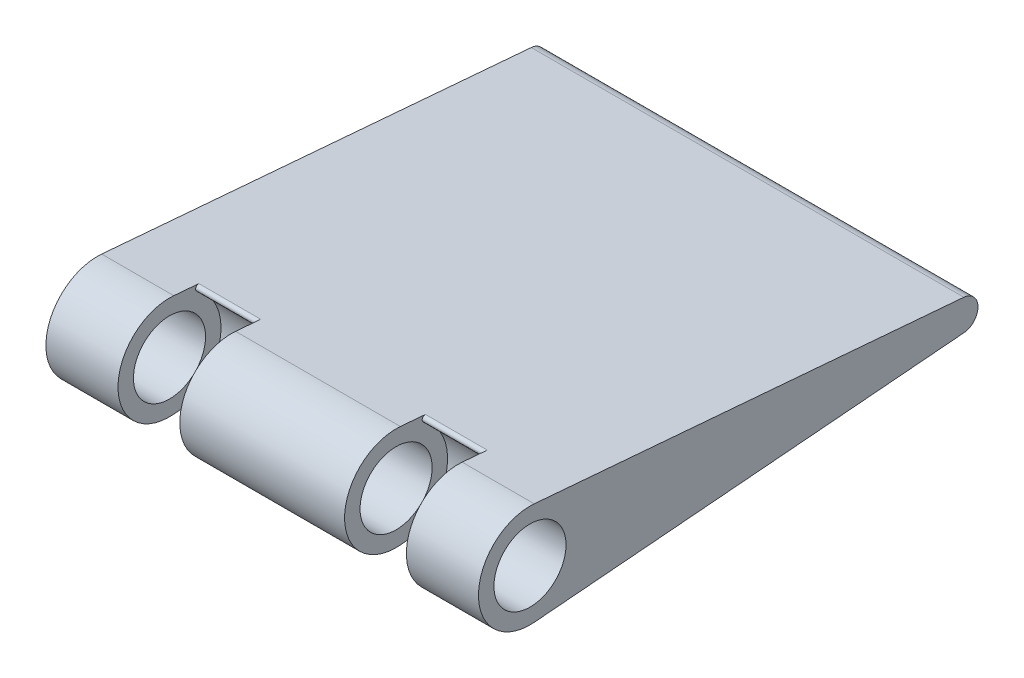
ISO-10303-21;
HEADER;
FILE_DESCRIPTION(('STEP AP214'),'2;1');
FILE_NAME('part.step','',(''),(''),'','','');
FILE_SCHEMA(('AUTOMOTIVE_DESIGN { 1 0 10303 214 1 1 1 1 }'));
ENDSEC;
DATA;
#1=APPLICATION_CONTEXT('core data for automotive mechanical design processes');
#2=APPLICATION_PROTOCOL_DEFINITION('international standard','automotive_design',2000,#1);
#3=PRODUCT_CONTEXT('',#1,'mechanical');
#4=PRODUCT('Part','Part','',(#3));
#5=PRODUCT_RELATED_PRODUCT_CATEGORY('part','',(#4));
#6=PRODUCT_DEFINITION_FORMATION('','',#4);
#7=PRODUCT_DEFINITION_CONTEXT('part definition',#1,'design');
#8=PRODUCT_DEFINITION('design','',#6,#7);
#9=PRODUCT_DEFINITION_SHAPE('','',#8);
#10=(LENGTH_UNIT() NAMED_UNIT(*) SI_UNIT(.MILLI.,.METRE.));
#11=(NAMED_UNIT(*) PLANE_ANGLE_UNIT() SI_UNIT($,.RADIAN.));
#12=(NAMED_UNIT(*) SI_UNIT($,.STERADIAN.) SOLID_ANGLE_UNIT());
#13=UNCERTAINTY_MEASURE_WITH_UNIT(LENGTH_MEASURE(1.E-05),#10,'distance_accuracy_value','');
#14=(GEOMETRIC_REPRESENTATION_CONTEXT(3) GLOBAL_UNCERTAINTY_ASSIGNED_CONTEXT((#13)) GLOBAL_UNIT_ASSIGNED_CONTEXT((#10,
#11,#12)) REPRESENTATION_CONTEXT('',''));
#15=CARTESIAN_POINT('',(0.,0.,0.));
#16=DIRECTION('',(0.,0.,1.));
#17=DIRECTION('',(1.,0.,0.));
#18=AXIS2_PLACEMENT_3D('',#15,#16,#17);
#19=CARTESIAN_POINT('',(21.,0.,0.));
#20=DIRECTION('',(-1.,0.,0.));
#21=DIRECTION('',(0.,0.,1.));
#22=AXIS2_PLACEMENT_3D('',#19,#20,#21);
#23=CYLINDRICAL_SURFACE('',#22,5.);
#24=CARTESIAN_POINT('',(-14.,0.,0.));
#25=DIRECTION('',(1.,0.,0.));
#26=DIRECTION('',(0.,0.,-1.));
#27=AXIS2_PLACEMENT_3D('',#24,#25,#26);
#28=CIRCLE('',#27,5.);
#29=CARTESIAN_POINT('',(-14.,4.98260864295892,-0.416666666666667));
#30=VERTEX_POINT('',#29);
#31=CARTESIAN_POINT('',(-14.,-4.98260864295892,-0.416666666666667));
#32=VERTEX_POINT('',#31);
#33=EDGE_CURVE('E163',#30,#32,#28,.T.);
#34=ORIENTED_EDGE('',*,*,#33,.F.);
#35=DIRECTION('',(-1.,0.,0.));
#36=VECTOR('',#35,1.);
#37=CARTESIAN_POINT('',(21.,4.98260864295892,-0.416666666666662));
#38=LINE('',#37,#36);
#39=CARTESIAN_POINT('',(-21.,4.98260864295892,-0.416666666666662));
#40=VERTEX_POINT('',#39);
#41=EDGE_CURVE('E184',#30,#40,#38,.T.);
#42=ORIENTED_EDGE('',*,*,#41,.T.);
#43=CARTESIAN_POINT('',(-21.,0.,0.));
#44=DIRECTION('',(1.,0.,0.));
#45=DIRECTION('',(0.,0.,-1.));
#46=AXIS2_PLACEMENT_3D('',#43,#44,#45);
#47=CIRCLE('',#46,5.);
#48=CARTESIAN_POINT('',(-21.,-4.98260864295892,-0.416666666666662));
#49=VERTEX_POINT('',#48);
#50=EDGE_CURVE('E173',#40,#49,#47,.T.);
#51=ORIENTED_EDGE('',*,*,#50,.T.);
#52=DIRECTION('',(-1.,0.,0.));
#53=VECTOR('',#52,1.);
#54=CARTESIAN_POINT('',(21.,-4.98260864295892,-0.416666666666662));
#55=LINE('',#54,#53);
#56=EDGE_CURVE('E153',#32,#49,#55,.T.);
#57=ORIENTED_EDGE('',*,*,#56,.F.);
#58=EDGE_LOOP('',(#34,#42,#51,#57));
#59=FACE_BOUND('',#58,.T.);
#60=ADVANCED_FACE('F34',(#59),#23,.T.);
#61=CARTESIAN_POINT('',(21.,0.,0.));
#62=DIRECTION('',(-1.,0.,0.));
#63=DIRECTION('',(0.,0.,1.));
#64=AXIS2_PLACEMENT_3D('',#61,#62,#63);
#65=CYLINDRICAL_SURFACE('',#64,3.5);
#66=CARTESIAN_POINT('',(-21.,0.,0.));
#67=DIRECTION('',(1.,0.,0.));
#68=DIRECTION('',(0.,0.,-1.));
#69=AXIS2_PLACEMENT_3D('',#66,#67,#68);
#70=CIRCLE('',#69,3.5);
#71=CARTESIAN_POINT('',(-21.,0.,-3.5));
#72=VERTEX_POINT('',#71);
#73=EDGE_CURVE('E281',#72,#72,#70,.T.);
#74=ORIENTED_EDGE('',*,*,#73,.F.);
#75=EDGE_LOOP('',(#74));
#76=FACE_BOUND('',#75,.T.);
#77=CARTESIAN_POINT('',(-14.,0.,0.));
#78=DIRECTION('',(1.,0.,0.));
#79=DIRECTION('',(0.,0.,-1.));
#80=AXIS2_PLACEMENT_3D('',#77,#78,#79);
#81=CIRCLE('',#80,3.5);
#82=CARTESIAN_POINT('',(-14.,0.,-3.5));
#83=VERTEX_POINT('',#82);
#84=EDGE_CURVE('E306',#83,#83,#81,.T.);
#85=ORIENTED_EDGE('',*,*,#84,.T.);
#86=EDGE_LOOP('',(#85));
#87=FACE_BOUND('',#86,.T.);
#88=ADVANCED_FACE('F297',(#76,#87),#65,.F.);
#89=CARTESIAN_POINT('',(8.,4.98260864295892,-0.416666666666662));
#90=VERTEX_POINT('',#89);
#91=CARTESIAN_POINT('',(-7.99999999999999,4.98260864295892,-0.416666666666662));
#92=VERTEX_POINT('',#91);
#93=EDGE_CURVE('E188',#90,#92,#38,.T.);
#94=ORIENTED_EDGE('',*,*,#93,.T.);
#95=CARTESIAN_POINT('',(-8.,0.,0.));
#96=DIRECTION('',(1.,0.,0.));
#97=DIRECTION('',(0.,0.,-1.));
#98=AXIS2_PLACEMENT_3D('',#95,#96,#97);
#99=CIRCLE('',#98,5.);
#100=CARTESIAN_POINT('',(-8.,-4.98260864295892,-0.416666666666667));
#101=VERTEX_POINT('',#100);
#102=EDGE_CURVE('E308',#92,#101,#99,.T.);
#103=ORIENTED_EDGE('',*,*,#102,.T.);
#104=CARTESIAN_POINT('',(8.,-4.98260864295892,-0.416666666666662));
#105=VERTEX_POINT('',#104);
#106=EDGE_CURVE('E175',#105,#101,#55,.T.);
#107=ORIENTED_EDGE('',*,*,#106,.F.);
#108=CARTESIAN_POINT('',(8.,0.,0.));
#109=DIRECTION('',(1.,0.,0.));
#110=DIRECTION('',(0.,0.,-1.));
#111=AXIS2_PLACEMENT_3D('',#108,#109,#110);
#112=CIRCLE('',#111,5.);
#113=EDGE_CURVE('E270',#90,#105,#112,.T.);
#114=ORIENTED_EDGE('',*,*,#113,.F.);
#115=EDGE_LOOP('',(#94,#103,#107,#114));
#116=FACE_BOUND('',#115,.T.);
#117=ADVANCED_FACE('F300',(#116),#23,.T.);
#118=CARTESIAN_POINT('',(-8.,0.,0.));
#119=DIRECTION('',(1.,0.,0.));
#120=DIRECTION('',(0.,0.,-1.));
#121=AXIS2_PLACEMENT_3D('',#118,#119,#120);
#122=CIRCLE('',#121,3.5);
#123=CARTESIAN_POINT('',(-8.,0.,-3.5));
#124=VERTEX_POINT('',#123);
#125=EDGE_CURVE('E314',#124,#124,#122,.T.);
#126=ORIENTED_EDGE('',*,*,#125,.F.);
#127=EDGE_LOOP('',(#126));
#128=FACE_BOUND('',#127,.T.);
#129=CARTESIAN_POINT('',(8.,0.,0.));
#130=DIRECTION('',(1.,0.,0.));
#131=DIRECTION('',(0.,0.,-1.));
#132=AXIS2_PLACEMENT_3D('',#129,#130,#131);
#133=CIRCLE('',#132,3.5);
#134=CARTESIAN_POINT('',(8.,0.,-3.5));
#135=VERTEX_POINT('',#134);
#136=EDGE_CURVE('E169',#135,#135,#133,.T.);
#137=ORIENTED_EDGE('',*,*,#136,.T.);
#138=EDGE_LOOP('',(#137));
#139=FACE_BOUND('',#138,.T.);
#140=ADVANCED_FACE('F302',(#128,#139),#65,.F.);
#141=CARTESIAN_POINT('',(21.,-0.173635949773063,-57.9236160382377));
#142=DIRECTION('',(0.,0.996521728591783,0.0833333333333333));
#143=DIRECTION('',(0.,-0.0833333333333333,0.996521728591783));
#144=AXIS2_PLACEMENT_3D('',#141,#142,#143);
#145=PLANE('',#144);
#146=ORIENTED_EDGE('',*,*,#106,.T.);
#147=DIRECTION('',(0.,0.0833333333333333,-0.996521728591783));
#148=VECTOR('',#147,1.);
#149=CARTESIAN_POINT('',(-8.,-0.173635949773063,-57.9236160382377));
#150=LINE('',#149,#148);
#151=CARTESIAN_POINT('',(-8.,-4.77848449772698,-2.8576364193128));
#152=VERTEX_POINT('',#151);
#153=EDGE_CURVE('E217',#101,#152,#150,.T.);
#154=ORIENTED_EDGE('',*,*,#153,.T.);
#155=DIRECTION('',(1.,0.,0.));
#156=VECTOR('',#155,1.);
#157=CARTESIAN_POINT('',(21.,-4.77848449772698,-2.8576364193128));
#158=LINE('',#157,#156);
#159=CARTESIAN_POINT('',(-14.,-4.77848449772698,-2.8576364193128));
#160=VERTEX_POINT('',#159);
#161=EDGE_CURVE('E157',#152,#160,#158,.F.);
#162=ORIENTED_EDGE('',*,*,#161,.T.);
#163=DIRECTION('',(0.,-0.0833333333333333,0.996521728591783));
#164=VECTOR('',#163,1.);
#165=CARTESIAN_POINT('',(-14.,-0.173635949773063,-57.9236160382377));
#166=LINE('',#165,#164);
#167=EDGE_CURVE('E147',#160,#32,#166,.T.);
#168=ORIENTED_EDGE('',*,*,#167,.T.);
#169=ORIENTED_EDGE('',*,*,#56,.T.);
#170=DIRECTION('',(0.,0.0833333333333333,-0.996521728591783));
#171=VECTOR('',#170,1.);
#172=CARTESIAN_POINT('',(-21.,-0.173635949773063,-57.9236160382377));
#173=LINE('',#172,#171);
#174=CARTESIAN_POINT('',(-21.,-1.49478259288768,-42.125));
#175=VERTEX_POINT('',#174);
#176=EDGE_CURVE('E268',#49,#175,#173,.T.);
#177=ORIENTED_EDGE('',*,*,#176,.T.);
#178=DIRECTION('',(-1.,0.,0.));
#179=VECTOR('',#178,1.);
#180=CARTESIAN_POINT('',(21.,-1.49478259288768,-42.125));
#181=LINE('',#180,#179);
#182=CARTESIAN_POINT('',(21.,-1.49478259288768,-42.125));
#183=VERTEX_POINT('',#182);
#184=EDGE_CURVE('E196',#183,#175,#181,.T.);
#185=ORIENTED_EDGE('',*,*,#184,.F.);
#186=DIRECTION('',(0.,0.0833333333333333,-0.996521728591783));
#187=VECTOR('',#186,1.);
#188=CARTESIAN_POINT('',(21.,-0.173635949773063,-57.9236160382377));
#189=LINE('',#188,#187);
#190=CARTESIAN_POINT('',(21.,-4.98260864295892,-0.416666666666662));
#191=VERTEX_POINT('',#190);
#192=EDGE_CURVE('E277',#191,#183,#189,.T.);
#193=ORIENTED_EDGE('',*,*,#192,.F.);
#194=CARTESIAN_POINT('',(14.,-4.98260864295892,-0.416666666666662));
#195=VERTEX_POINT('',#194);
#196=EDGE_CURVE('E178',#191,#195,#55,.T.);
#197=ORIENTED_EDGE('',*,*,#196,.T.);
#198=DIRECTION('',(0.,0.0833333333333333,-0.996521728591783));
#199=VECTOR('',#198,1.);
#200=CARTESIAN_POINT('',(14.,-0.173635949773063,-57.9236160382377));
#201=LINE('',#200,#199);
#202=CARTESIAN_POINT('',(14.,-4.77848449772698,-2.8576364193128));
#203=VERTEX_POINT('',#202);
#204=EDGE_CURVE('E57',#195,#203,#201,.T.);
#205=ORIENTED_EDGE('',*,*,#204,.T.);
#206=DIRECTION('',(1.,0.,0.));
#207=VECTOR('',#206,1.);
#208=CARTESIAN_POINT('',(8.,-4.77848449772698,-2.8576364193128));
#209=LINE('',#208,#207);
#210=CARTESIAN_POINT('',(8.,-4.77848449772698,-2.8576364193128));
#211=VERTEX_POINT('',#210);
#212=EDGE_CURVE('E212',#203,#211,#209,.F.);
#213=ORIENTED_EDGE('',*,*,#212,.T.);
#214=DIRECTION('',(0.,-0.0833333333333333,0.996521728591783));
#215=VECTOR('',#214,1.);
#216=CARTESIAN_POINT('',(8.,-0.173635949773063,-57.9236160382377));
#217=LINE('',#216,#215);
#218=EDGE_CURVE('E160',#211,#105,#217,.T.);
#219=ORIENTED_EDGE('',*,*,#218,.T.);
#220=EDGE_LOOP('',(#146,#154,#162,#168,#169,#177,#185,#193,#197,#205,#213,#219));
#221=FACE_BOUND('',#220,.T.);
#222=ADVANCED_FACE('F150',(#221),#145,.F.);
#223=CARTESIAN_POINT('',(21.,0.,-42.));
#224=DIRECTION('',(-1.,0.,0.));
#225=DIRECTION('',(0.,0.,1.));
#226=AXIS2_PLACEMENT_3D('',#223,#224,#225);
#227=CYLINDRICAL_SURFACE('',#226,1.5);
#228=CARTESIAN_POINT('',(-21.,0.,-42.));
#229=DIRECTION('',(1.,0.,0.));
#230=DIRECTION('',(0.,0.,-1.));
#231=AXIS2_PLACEMENT_3D('',#228,#229,#230);
#232=CIRCLE('',#231,1.5);
#233=CARTESIAN_POINT('',(-21.,1.49478259288768,-42.125));
#234=VERTEX_POINT('',#233);
#235=EDGE_CURVE('E287',#175,#234,#232,.T.);
#236=ORIENTED_EDGE('',*,*,#235,.T.);
#237=DIRECTION('',(-1.,0.,0.));
#238=VECTOR('',#237,1.);
#239=CARTESIAN_POINT('',(21.,1.49478259288768,-42.125));
#240=LINE('',#239,#238);
#241=CARTESIAN_POINT('',(21.,1.49478259288768,-42.125));
#242=VERTEX_POINT('',#241);
#243=EDGE_CURVE('E193',#242,#234,#240,.T.);
#244=ORIENTED_EDGE('',*,*,#243,.F.);
#245=CARTESIAN_POINT('',(21.,0.,-42.));
#246=DIRECTION('',(1.,0.,0.));
#247=DIRECTION('',(0.,0.,-1.));
#248=AXIS2_PLACEMENT_3D('',#245,#246,#247);
#249=CIRCLE('',#248,1.5);
#250=EDGE_CURVE('E280',#183,#242,#249,.T.);
#251=ORIENTED_EDGE('',*,*,#250,.F.);
#252=ORIENTED_EDGE('',*,*,#184,.T.);
#253=EDGE_LOOP('',(#236,#244,#251,#252));
#254=FACE_BOUND('',#253,.T.);
#255=ADVANCED_FACE('F333',(#254),#227,.T.);
#256=CARTESIAN_POINT('',(21.,0.173635949773063,-57.9236160382377));
#257=DIRECTION('',(0.,0.996521728591783,-0.0833333333333333));
#258=DIRECTION('',(0.,0.0833333333333333,0.996521728591783));
#259=AXIS2_PLACEMENT_3D('',#256,#257,#258);
#260=PLANE('',#259);
#261=ORIENTED_EDGE('',*,*,#41,.F.);
#262=DIRECTION('',(0.,-0.0833333333333333,-0.996521728591783));
#263=VECTOR('',#262,1.);
#264=CARTESIAN_POINT('',(-14.,0.173635949773063,-57.9236160382377));
#265=LINE('',#264,#263);
#266=CARTESIAN_POINT('',(-14.,4.77848449772698,-2.8576364193128));
#267=VERTEX_POINT('',#266);
#268=EDGE_CURVE('E166',#30,#267,#265,.T.);
#269=ORIENTED_EDGE('',*,*,#268,.T.);
#270=DIRECTION('',(-1.,0.,0.));
#271=VECTOR('',#270,1.);
#272=CARTESIAN_POINT('',(-7.99999999999999,4.77848449772698,-2.8576364193128));
#273=LINE('',#272,#271);
#274=CARTESIAN_POINT('',(-8.,4.77848449772698,-2.8576364193128));
#275=VERTEX_POINT('',#274);
#276=EDGE_CURVE('E227',#267,#275,#273,.F.);
#277=ORIENTED_EDGE('',*,*,#276,.T.);
#278=DIRECTION('',(0.,0.0833333333333333,0.996521728591783));
#279=VECTOR('',#278,1.);
#280=CARTESIAN_POINT('',(-8.,0.173635949773063,-57.9236160382377));
#281=LINE('',#280,#279);
#282=EDGE_CURVE('E225',#275,#92,#281,.T.);
#283=ORIENTED_EDGE('',*,*,#282,.T.);
#284=ORIENTED_EDGE('',*,*,#93,.F.);
#285=DIRECTION('',(0.,-0.0833333333333333,-0.996521728591783));
#286=VECTOR('',#285,1.);
#287=CARTESIAN_POINT('',(8.,0.173635949773063,-57.9236160382377));
#288=LINE('',#287,#286);
#289=CARTESIAN_POINT('',(8.,4.77848449772698,-2.8576364193128));
#290=VERTEX_POINT('',#289);
#291=EDGE_CURVE('E49',#90,#290,#288,.T.);
#292=ORIENTED_EDGE('',*,*,#291,.T.);
#293=DIRECTION('',(-1.,0.,0.));
#294=VECTOR('',#293,1.);
#295=CARTESIAN_POINT('',(21.,4.77848449772698,-2.8576364193128));
#296=LINE('',#295,#294);
#297=CARTESIAN_POINT('',(14.,4.77848449772698,-2.8576364193128));
#298=VERTEX_POINT('',#297);
#299=EDGE_CURVE('E221',#290,#298,#296,.F.);
#300=ORIENTED_EDGE('',*,*,#299,.T.);
#301=DIRECTION('',(0.,0.0833333333333333,0.996521728591783));
#302=VECTOR('',#301,1.);
#303=CARTESIAN_POINT('',(14.,0.173635949773063,-57.9236160382377));
#304=LINE('',#303,#302);
#305=CARTESIAN_POINT('',(14.,4.98260864295892,-0.416666666666662));
#306=VERTEX_POINT('',#305);
#307=EDGE_CURVE('E219',#298,#306,#304,.T.);
#308=ORIENTED_EDGE('',*,*,#307,.T.);
#309=CARTESIAN_POINT('',(21.,4.98260864295892,-0.416666666666662));
#310=VERTEX_POINT('',#309);
#311=EDGE_CURVE('E189',#310,#306,#38,.T.);
#312=ORIENTED_EDGE('',*,*,#311,.F.);
#313=DIRECTION('',(0.,-0.0833333333333333,-0.996521728591783));
#314=VECTOR('',#313,1.);
#315=CARTESIAN_POINT('',(21.,0.173635949773063,-57.9236160382377));
#316=LINE('',#315,#314);
#317=EDGE_CURVE('E283',#310,#242,#316,.T.);
#318=ORIENTED_EDGE('',*,*,#317,.T.);
#319=ORIENTED_EDGE('',*,*,#243,.T.);
#320=DIRECTION('',(0.,-0.0833333333333333,-0.996521728591783));
#321=VECTOR('',#320,1.);
#322=CARTESIAN_POINT('',(-21.,0.173635949773063,-57.9236160382377));
#323=LINE('',#322,#321);
#324=EDGE_CURVE('E289',#40,#234,#323,.T.);
#325=ORIENTED_EDGE('',*,*,#324,.F.);
#326=EDGE_LOOP('',(#261,#269,#277,#283,#284,#292,#300,#308,#312,#318,#319,#325));
#327=FACE_BOUND('',#326,.T.);
#328=ADVANCED_FACE('F254',(#327),#260,.T.);
#329=ORIENTED_EDGE('',*,*,#311,.T.);
#330=CARTESIAN_POINT('',(14.,0.,0.));
#331=DIRECTION('',(1.,0.,0.));
#332=DIRECTION('',(0.,0.,-1.));
#333=AXIS2_PLACEMENT_3D('',#330,#331,#332);
#334=CIRCLE('',#333,5.);
#335=EDGE_CURVE('E265',#306,#195,#334,.T.);
#336=ORIENTED_EDGE('',*,*,#335,.T.);
#337=ORIENTED_EDGE('',*,*,#196,.F.);
#338=CARTESIAN_POINT('',(21.,0.,0.));
#339=DIRECTION('',(1.,0.,0.));
#340=DIRECTION('',(0.,0.,-1.));
#341=AXIS2_PLACEMENT_3D('',#338,#339,#340);
#342=CIRCLE('',#341,5.);
#343=EDGE_CURVE('E180',#310,#191,#342,.T.);
#344=ORIENTED_EDGE('',*,*,#343,.F.);
#345=EDGE_LOOP('',(#329,#336,#337,#344));
#346=FACE_BOUND('',#345,.T.);
#347=ADVANCED_FACE('F338',(#346),#23,.T.);
#348=CARTESIAN_POINT('',(14.,0.,0.));
#349=DIRECTION('',(1.,0.,0.));
#350=DIRECTION('',(0.,0.,-1.));
#351=AXIS2_PLACEMENT_3D('',#348,#349,#350);
#352=CIRCLE('',#351,3.5);
#353=CARTESIAN_POINT('',(14.,0.,-3.5));
#354=VERTEX_POINT('',#353);
#355=EDGE_CURVE('E266',#354,#354,#352,.T.);
#356=ORIENTED_EDGE('',*,*,#355,.F.);
#357=EDGE_LOOP('',(#356));
#358=FACE_BOUND('',#357,.T.);
#359=CARTESIAN_POINT('',(21.,0.,0.));
#360=DIRECTION('',(1.,0.,0.));
#361=DIRECTION('',(0.,0.,-1.));
#362=AXIS2_PLACEMENT_3D('',#359,#360,#361);
#363=CIRCLE('',#362,3.5);
#364=CARTESIAN_POINT('',(21.,0.,-3.5));
#365=VERTEX_POINT('',#364);
#366=EDGE_CURVE('E176',#365,#365,#363,.T.);
#367=ORIENTED_EDGE('',*,*,#366,.T.);
#368=EDGE_LOOP('',(#367));
#369=FACE_BOUND('',#368,.T.);
#370=ADVANCED_FACE('F303',(#358,#369),#65,.F.);
#371=CARTESIAN_POINT('',(21.,0.,-57.9090958706729));
#372=DIRECTION('',(1.,0.,0.));
#373=DIRECTION('',(0.,0.,-1.));
#374=AXIS2_PLACEMENT_3D('',#371,#372,#373);
#375=PLANE('',#374);
#376=ORIENTED_EDGE('',*,*,#192,.T.);
#377=ORIENTED_EDGE('',*,*,#250,.T.);
#378=ORIENTED_EDGE('',*,*,#317,.F.);
#379=ORIENTED_EDGE('',*,*,#343,.T.);
#380=EDGE_LOOP('',(#376,#377,#378,#379));
#381=FACE_BOUND('',#380,.T.);
#382=ORIENTED_EDGE('',*,*,#366,.F.);
#383=EDGE_LOOP('',(#382));
#384=FACE_BOUND('',#383,.T.);
#385=ADVANCED_FACE('F336',(#381,#384),#375,.T.);
#386=CARTESIAN_POINT('',(-21.,0.,-57.9090958706729));
#387=DIRECTION('',(1.,0.,0.));
#388=DIRECTION('',(0.,0.,-1.));
#389=AXIS2_PLACEMENT_3D('',#386,#387,#388);
#390=PLANE('',#389);
#391=ORIENTED_EDGE('',*,*,#176,.F.);
#392=ORIENTED_EDGE('',*,*,#50,.F.);
#393=ORIENTED_EDGE('',*,*,#324,.T.);
#394=ORIENTED_EDGE('',*,*,#235,.F.);
#395=EDGE_LOOP('',(#391,#392,#393,#394));
#396=FACE_BOUND('',#395,.T.);
#397=ORIENTED_EDGE('',*,*,#73,.T.);
#398=EDGE_LOOP('',(#397));
#399=FACE_BOUND('',#398,.T.);
#400=ADVANCED_FACE('F295',(#396,#399),#390,.F.);
#401=CARTESIAN_POINT('',(14.,0.,0.));
#402=DIRECTION('',(-1.,0.,0.));
#403=DIRECTION('',(0.,0.,1.));
#404=AXIS2_PLACEMENT_3D('',#401,#402,#403);
#405=CYLINDRICAL_SURFACE('',#404,5.);
#406=CARTESIAN_POINT('',(8.,-4.22596979165042,-2.67229850878566));
#407=VERTEX_POINT('',#406);
#408=CARTESIAN_POINT('',(8.,4.22596979165042,-2.67229850878566));
#409=VERTEX_POINT('',#408);
#410=EDGE_CURVE('E250',#407,#409,#112,.T.);
#411=ORIENTED_EDGE('',*,*,#410,.F.);
#412=DIRECTION('',(-1.,0.,0.));
#413=VECTOR('',#412,1.);
#414=CARTESIAN_POINT('',(14.,-4.22596979165042,-2.67229850878566));
#415=LINE('',#414,#413);
#416=CARTESIAN_POINT('',(14.,-4.22596979165042,-2.67229850878566));
#417=VERTEX_POINT('',#416);
#418=EDGE_CURVE('E234',#407,#417,#415,.F.);
#419=ORIENTED_EDGE('',*,*,#418,.T.);
#420=CARTESIAN_POINT('',(14.,4.22596979165042,-2.67229850878566));
#421=VERTEX_POINT('',#420);
#422=EDGE_CURVE('E260',#417,#421,#334,.T.);
#423=ORIENTED_EDGE('',*,*,#422,.T.);
#424=DIRECTION('',(-1.,0.,0.));
#425=VECTOR('',#424,1.);
#426=CARTESIAN_POINT('',(14.,4.22596979165042,-2.67229850878566));
#427=LINE('',#426,#425);
#428=EDGE_CURVE('E231',#421,#409,#427,.T.);
#429=ORIENTED_EDGE('',*,*,#428,.T.);
#430=EDGE_LOOP('',(#411,#419,#423,#429));
#431=FACE_BOUND('',#430,.T.);
#432=ADVANCED_FACE('F263',(#431),#405,.F.);
#433=CARTESIAN_POINT('',(14.,0.,-57.9090958706729));
#434=DIRECTION('',(1.,0.,0.));
#435=DIRECTION('',(0.,0.,-1.));
#436=AXIS2_PLACEMENT_3D('',#433,#434,#435);
#437=PLANE('',#436);
#438=ORIENTED_EDGE('',*,*,#355,.T.);
#439=EDGE_LOOP('',(#438));
#440=FACE_BOUND('',#439,.T.);
#441=ORIENTED_EDGE('',*,*,#335,.F.);
#442=ORIENTED_EDGE('',*,*,#307,.F.);
#443=CARTESIAN_POINT('',(14.,4.47952797914945,-2.8326364193128));
#444=DIRECTION('',(1.,0.,0.));
#445=DIRECTION('',(0.,0.,-1.));
#446=AXIS2_PLACEMENT_3D('',#443,#444,#445);
#447=CIRCLE('',#446,0.3);
#448=EDGE_CURVE('E11',#298,#421,#447,.T.);
#449=ORIENTED_EDGE('',*,*,#448,.T.);
#450=ORIENTED_EDGE('',*,*,#422,.F.);
#451=CARTESIAN_POINT('',(14.,-4.47952797914945,-2.8326364193128));
#452=DIRECTION('',(1.,0.,0.));
#453=DIRECTION('',(0.,0.,-1.));
#454=AXIS2_PLACEMENT_3D('',#451,#452,#453);
#455=CIRCLE('',#454,0.3);
#456=EDGE_CURVE('E246',#417,#203,#455,.T.);
#457=ORIENTED_EDGE('',*,*,#456,.T.);
#458=ORIENTED_EDGE('',*,*,#204,.F.);
#459=EDGE_LOOP('',(#441,#442,#449,#450,#457,#458));
#460=FACE_BOUND('',#459,.T.);
#461=ADVANCED_FACE('F259',(#440,#460),#437,.F.);
#462=CARTESIAN_POINT('',(8.,0.,-57.9090958706729));
#463=DIRECTION('',(1.,0.,0.));
#464=DIRECTION('',(0.,0.,-1.));
#465=AXIS2_PLACEMENT_3D('',#462,#463,#464);
#466=PLANE('',#465);
#467=ORIENTED_EDGE('',*,*,#136,.F.);
#468=EDGE_LOOP('',(#467));
#469=FACE_BOUND('',#468,.T.);
#470=ORIENTED_EDGE('',*,*,#113,.T.);
#471=ORIENTED_EDGE('',*,*,#218,.F.);
#472=CARTESIAN_POINT('',(8.,-4.47952797914945,-2.8326364193128));
#473=DIRECTION('',(1.,0.,0.));
#474=DIRECTION('',(0.,0.,-1.));
#475=AXIS2_PLACEMENT_3D('',#472,#473,#474);
#476=CIRCLE('',#475,0.3);
#477=EDGE_CURVE('E244',#211,#407,#476,.F.);
#478=ORIENTED_EDGE('',*,*,#477,.T.);
#479=ORIENTED_EDGE('',*,*,#410,.T.);
#480=CARTESIAN_POINT('',(8.,4.47952797914945,-2.8326364193128));
#481=DIRECTION('',(1.,0.,0.));
#482=DIRECTION('',(0.,0.,-1.));
#483=AXIS2_PLACEMENT_3D('',#480,#481,#482);
#484=CIRCLE('',#483,0.3);
#485=EDGE_CURVE('E42',#409,#290,#484,.F.);
#486=ORIENTED_EDGE('',*,*,#485,.T.);
#487=ORIENTED_EDGE('',*,*,#291,.F.);
#488=EDGE_LOOP('',(#470,#471,#478,#479,#486,#487));
#489=FACE_BOUND('',#488,.T.);
#490=ADVANCED_FACE('F248',(#469,#489),#466,.T.);
#491=CARTESIAN_POINT('',(-14.,0.,0.));
#492=DIRECTION('',(1.,0.,0.));
#493=DIRECTION('',(0.,0.,-1.));
#494=AXIS2_PLACEMENT_3D('',#491,#492,#493);
#495=CYLINDRICAL_SURFACE('',#494,5.);
#496=CARTESIAN_POINT('',(-14.,-4.22596979165042,-2.67229850878566));
#497=VERTEX_POINT('',#496);
#498=CARTESIAN_POINT('',(-14.,4.22596979165042,-2.67229850878566));
#499=VERTEX_POINT('',#498);
#500=EDGE_CURVE('E170',#497,#499,#28,.T.);
#501=ORIENTED_EDGE('',*,*,#500,.F.);
#502=DIRECTION('',(1.,0.,0.));
#503=VECTOR('',#502,1.);
#504=CARTESIAN_POINT('',(-14.,-4.22596979165042,-2.67229850878566));
#505=LINE('',#504,#503);
#506=CARTESIAN_POINT('',(-8.,-4.22596979165042,-2.67229850878566));
#507=VERTEX_POINT('',#506);
#508=EDGE_CURVE('E208',#497,#507,#505,.T.);
#509=ORIENTED_EDGE('',*,*,#508,.T.);
#510=CARTESIAN_POINT('',(-8.,4.22596979165042,-2.67229850878566));
#511=VERTEX_POINT('',#510);
#512=EDGE_CURVE('E312',#507,#511,#99,.T.);
#513=ORIENTED_EDGE('',*,*,#512,.T.);
#514=DIRECTION('',(1.,0.,0.));
#515=VECTOR('',#514,1.);
#516=CARTESIAN_POINT('',(-14.,4.22596979165042,-2.67229850878566));
#517=LINE('',#516,#515);
#518=EDGE_CURVE('E203',#511,#499,#517,.F.);
#519=ORIENTED_EDGE('',*,*,#518,.T.);
#520=EDGE_LOOP('',(#501,#509,#513,#519));
#521=FACE_BOUND('',#520,.T.);
#522=ADVANCED_FACE('F323',(#521),#495,.F.);
#523=CARTESIAN_POINT('',(-14.,0.,-57.9090958706729));
#524=DIRECTION('',(1.,0.,0.));
#525=DIRECTION('',(0.,0.,-1.));
#526=AXIS2_PLACEMENT_3D('',#523,#524,#525);
#527=PLANE('',#526);
#528=ORIENTED_EDGE('',*,*,#84,.F.);
#529=EDGE_LOOP('',(#528));
#530=FACE_BOUND('',#529,.T.);
#531=ORIENTED_EDGE('',*,*,#33,.T.);
#532=ORIENTED_EDGE('',*,*,#167,.F.);
#533=CARTESIAN_POINT('',(-14.,-4.47952797914945,-2.8326364193128));
#534=DIRECTION('',(1.,0.,0.));
#535=DIRECTION('',(0.,0.,-1.));
#536=AXIS2_PLACEMENT_3D('',#533,#534,#535);
#537=CIRCLE('',#536,0.3);
#538=EDGE_CURVE('E238',#160,#497,#537,.F.);
#539=ORIENTED_EDGE('',*,*,#538,.T.);
#540=ORIENTED_EDGE('',*,*,#500,.T.);
#541=CARTESIAN_POINT('',(-14.,4.47952797914945,-2.8326364193128));
#542=DIRECTION('',(1.,0.,0.));
#543=DIRECTION('',(0.,0.,-1.));
#544=AXIS2_PLACEMENT_3D('',#541,#542,#543);
#545=CIRCLE('',#544,0.3);
#546=EDGE_CURVE('E240',#499,#267,#545,.F.);
#547=ORIENTED_EDGE('',*,*,#546,.T.);
#548=ORIENTED_EDGE('',*,*,#268,.F.);
#549=EDGE_LOOP('',(#531,#532,#539,#540,#547,#548));
#550=FACE_BOUND('',#549,.T.);
#551=ADVANCED_FACE('F164',(#530,#550),#527,.T.);
#552=CARTESIAN_POINT('',(-8.,0.,-57.9090958706729));
#553=DIRECTION('',(1.,0.,0.));
#554=DIRECTION('',(0.,0.,-1.));
#555=AXIS2_PLACEMENT_3D('',#552,#553,#554);
#556=PLANE('',#555);
#557=ORIENTED_EDGE('',*,*,#125,.T.);
#558=EDGE_LOOP('',(#557));
#559=FACE_BOUND('',#558,.T.);
#560=ORIENTED_EDGE('',*,*,#102,.F.);
#561=ORIENTED_EDGE('',*,*,#282,.F.);
#562=CARTESIAN_POINT('',(-8.,4.47952797914945,-2.8326364193128));
#563=DIRECTION('',(1.,0.,0.));
#564=DIRECTION('',(0.,0.,-1.));
#565=AXIS2_PLACEMENT_3D('',#562,#563,#564);
#566=CIRCLE('',#565,0.3);
#567=EDGE_CURVE('E242',#275,#511,#566,.T.);
#568=ORIENTED_EDGE('',*,*,#567,.T.);
#569=ORIENTED_EDGE('',*,*,#512,.F.);
#570=CARTESIAN_POINT('',(-8.,-4.47952797914945,-2.8326364193128));
#571=DIRECTION('',(1.,0.,0.));
#572=DIRECTION('',(0.,0.,-1.));
#573=AXIS2_PLACEMENT_3D('',#570,#571,#572);
#574=CIRCLE('',#573,0.3);
#575=EDGE_CURVE('E236',#507,#152,#574,.T.);
#576=ORIENTED_EDGE('',*,*,#575,.T.);
#577=ORIENTED_EDGE('',*,*,#153,.F.);
#578=EDGE_LOOP('',(#560,#561,#568,#569,#576,#577));
#579=FACE_BOUND('',#578,.T.);
#580=ADVANCED_FACE('F370',(#559,#579),#556,.F.);
#581=CARTESIAN_POINT('',(-14.,-4.47952797914945,-2.8326364193128));
#582=DIRECTION('',(1.,0.,0.));
#583=DIRECTION('',(0.,0.,-1.));
#584=AXIS2_PLACEMENT_3D('',#581,#582,#583);
#585=CYLINDRICAL_SURFACE('',#584,0.3);
#586=ORIENTED_EDGE('',*,*,#538,.F.);
#587=ORIENTED_EDGE('',*,*,#161,.F.);
#588=ORIENTED_EDGE('',*,*,#575,.F.);
#589=ORIENTED_EDGE('',*,*,#508,.F.);
#590=EDGE_LOOP('',(#586,#587,#588,#589));
#591=FACE_BOUND('',#590,.T.);
#592=ADVANCED_FACE('F365',(#591),#585,.T.);
#593=CARTESIAN_POINT('',(-14.,4.47952797914945,-2.8326364193128));
#594=DIRECTION('',(1.,0.,0.));
#595=DIRECTION('',(0.,0.,-1.));
#596=AXIS2_PLACEMENT_3D('',#593,#594,#595);
#597=CYLINDRICAL_SURFACE('',#596,0.3);
#598=ORIENTED_EDGE('',*,*,#567,.F.);
#599=ORIENTED_EDGE('',*,*,#276,.F.);
#600=ORIENTED_EDGE('',*,*,#546,.F.);
#601=ORIENTED_EDGE('',*,*,#518,.F.);
#602=EDGE_LOOP('',(#598,#599,#600,#601));
#603=FACE_BOUND('',#602,.T.);
#604=ADVANCED_FACE('F328',(#603),#597,.T.);
#605=CARTESIAN_POINT('',(14.,-4.47952797914945,-2.8326364193128));
#606=DIRECTION('',(-1.,0.,0.));
#607=DIRECTION('',(0.,0.,1.));
#608=AXIS2_PLACEMENT_3D('',#605,#606,#607);
#609=CYLINDRICAL_SURFACE('',#608,0.3);
#610=ORIENTED_EDGE('',*,*,#456,.F.);
#611=ORIENTED_EDGE('',*,*,#418,.F.);
#612=ORIENTED_EDGE('',*,*,#477,.F.);
#613=ORIENTED_EDGE('',*,*,#212,.F.);
#614=EDGE_LOOP('',(#610,#611,#612,#613));
#615=FACE_BOUND('',#614,.T.);
#616=ADVANCED_FACE('F359',(#615),#609,.T.);
#617=CARTESIAN_POINT('',(14.,4.47952797914945,-2.8326364193128));
#618=DIRECTION('',(-1.,0.,0.));
#619=DIRECTION('',(0.,0.,1.));
#620=AXIS2_PLACEMENT_3D('',#617,#618,#619);
#621=CYLINDRICAL_SURFACE('',#620,0.3);
#622=ORIENTED_EDGE('',*,*,#448,.F.);
#623=ORIENTED_EDGE('',*,*,#299,.F.);
#624=ORIENTED_EDGE('',*,*,#485,.F.);
#625=ORIENTED_EDGE('',*,*,#428,.F.);
#626=EDGE_LOOP('',(#622,#623,#624,#625));
#627=FACE_BOUND('',#626,.T.);
#628=ADVANCED_FACE('F36',(#627),#621,.T.);
#629=CLOSED_SHELL('',(#60,#88,#117,#140,#222,#255,#328,#347,#370,#385,#400,#432,#461,#490,#522,
#551,#580,#592,#604,#616,#628));
#630=MANIFOLD_SOLID_BREP('B2',#629);
#631=ADVANCED_BREP_SHAPE_REPRESENTATION('',(#18,#630),#14);
#632=SHAPE_DEFINITION_REPRESENTATION(#9,#631);
ENDSEC;
END-ISO-10303-21;
